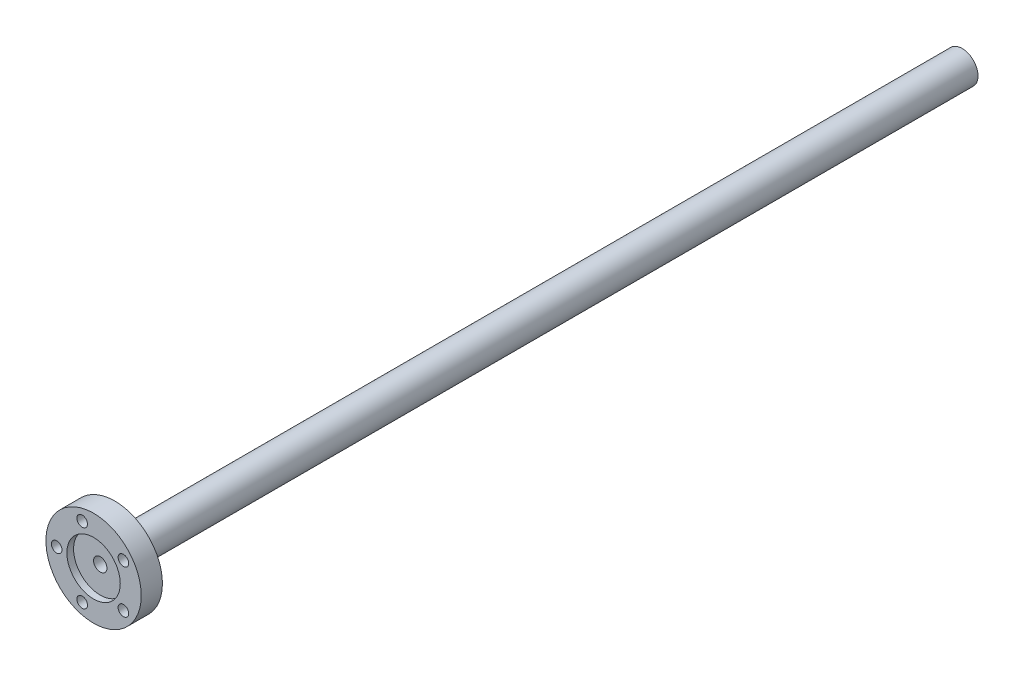
ISO-10303-21;
HEADER;
FILE_DESCRIPTION(('STEP AP214'),'2;1');
FILE_NAME('part.step','',(''),(''),'','','');
FILE_SCHEMA(('AUTOMOTIVE_DESIGN { 1 0 10303 214 1 1 1 1 }'));
ENDSEC;
DATA;
#1=APPLICATION_CONTEXT('core data for automotive mechanical design processes');
#2=APPLICATION_PROTOCOL_DEFINITION('international standard','automotive_design',2000,#1);
#3=PRODUCT_CONTEXT('',#1,'mechanical');
#4=PRODUCT('Part','Part','',(#3));
#5=PRODUCT_RELATED_PRODUCT_CATEGORY('part','',(#4));
#6=PRODUCT_DEFINITION_FORMATION('','',#4);
#7=PRODUCT_DEFINITION_CONTEXT('part definition',#1,'design');
#8=PRODUCT_DEFINITION('design','',#6,#7);
#9=PRODUCT_DEFINITION_SHAPE('','',#8);
#10=(LENGTH_UNIT() NAMED_UNIT(*) SI_UNIT(.MILLI.,.METRE.));
#11=(NAMED_UNIT(*) PLANE_ANGLE_UNIT() SI_UNIT($,.RADIAN.));
#12=(NAMED_UNIT(*) SI_UNIT($,.STERADIAN.) SOLID_ANGLE_UNIT());
#13=UNCERTAINTY_MEASURE_WITH_UNIT(LENGTH_MEASURE(1.E-05),#10,'distance_accuracy_value','');
#14=(GEOMETRIC_REPRESENTATION_CONTEXT(3) GLOBAL_UNCERTAINTY_ASSIGNED_CONTEXT((#13)) GLOBAL_UNIT_ASSIGNED_CONTEXT((#10,
#11,#12)) REPRESENTATION_CONTEXT('',''));
#15=CARTESIAN_POINT('',(0.,0.,0.));
#16=DIRECTION('',(0.,0.,1.));
#17=DIRECTION('',(1.,0.,0.));
#18=AXIS2_PLACEMENT_3D('',#15,#16,#17);
#19=CARTESIAN_POINT('',(14.2875,0.,-6.35));
#20=DIRECTION('',(0.,0.,-1.));
#21=DIRECTION('',(-1.,0.,0.));
#22=AXIS2_PLACEMENT_3D('',#19,#20,#21);
#23=PLANE('',#22);
#24=CARTESIAN_POINT('',(0.,0.,-6.35));
#25=DIRECTION('',(0.,0.,-1.));
#26=DIRECTION('',(-1.,0.,0.));
#27=AXIS2_PLACEMENT_3D('',#24,#25,#26);
#28=CIRCLE('',#27,5.5499);
#29=CARTESIAN_POINT('',(-5.5499,0.,-6.35));
#30=VERTEX_POINT('',#29);
#31=EDGE_CURVE('E11',#30,#30,#28,.F.);
#32=ORIENTED_EDGE('',*,*,#31,.T.);
#33=EDGE_LOOP('',(#32));
#34=FACE_BOUND('',#33,.T.);
#35=CARTESIAN_POINT('',(-3.41772795778692,10.5186850702244,-6.35));
#36=DIRECTION('',(0.,0.,-1.));
#37=DIRECTION('',(-1.,0.,0.));
#38=AXIS2_PLACEMENT_3D('',#35,#36,#37);
#39=CIRCLE('',#38,1.0922);
#40=CARTESIAN_POINT('',(-4.50992795778692,10.5186850702244,-6.35));
#41=VERTEX_POINT('',#40);
#42=EDGE_CURVE('E131',#41,#41,#39,.T.);
#43=ORIENTED_EDGE('',*,*,#42,.F.);
#44=EDGE_LOOP('',(#43));
#45=FACE_BOUND('',#44,.T.);
#46=CARTESIAN_POINT('',(8.94772795778692,6.50090489035475,-6.35));
#47=DIRECTION('',(0.,0.,-1.));
#48=DIRECTION('',(-1.,0.,0.));
#49=AXIS2_PLACEMENT_3D('',#46,#47,#48);
#50=CIRCLE('',#49,1.0922);
#51=CARTESIAN_POINT('',(7.85552795778692,6.50090489035475,-6.35));
#52=VERTEX_POINT('',#51);
#53=EDGE_CURVE('E126',#52,#52,#50,.T.);
#54=ORIENTED_EDGE('',*,*,#53,.F.);
#55=EDGE_LOOP('',(#54));
#56=FACE_BOUND('',#55,.T.);
#57=CARTESIAN_POINT('',(8.94772795778692,-6.50090489035475,-6.35));
#58=DIRECTION('',(0.,0.,-1.));
#59=DIRECTION('',(-1.,0.,0.));
#60=AXIS2_PLACEMENT_3D('',#57,#58,#59);
#61=CIRCLE('',#60,1.0922);
#62=CARTESIAN_POINT('',(7.85552795778692,-6.50090489035475,-6.35));
#63=VERTEX_POINT('',#62);
#64=EDGE_CURVE('E121',#63,#63,#61,.T.);
#65=ORIENTED_EDGE('',*,*,#64,.F.);
#66=EDGE_LOOP('',(#65));
#67=FACE_BOUND('',#66,.T.);
#68=CARTESIAN_POINT('',(-3.41772795778692,-10.5186850702244,-6.35));
#69=DIRECTION('',(0.,0.,-1.));
#70=DIRECTION('',(-1.,0.,0.));
#71=AXIS2_PLACEMENT_3D('',#68,#69,#70);
#72=CIRCLE('',#71,1.0922);
#73=CARTESIAN_POINT('',(-4.50992795778692,-10.5186850702244,-6.35));
#74=VERTEX_POINT('',#73);
#75=EDGE_CURVE('E116',#74,#74,#72,.T.);
#76=ORIENTED_EDGE('',*,*,#75,.F.);
#77=EDGE_LOOP('',(#76));
#78=FACE_BOUND('',#77,.T.);
#79=CARTESIAN_POINT('',(-11.06,0.,-6.34999999999999));
#80=DIRECTION('',(0.,0.,-1.));
#81=DIRECTION('',(-1.,0.,0.));
#82=AXIS2_PLACEMENT_3D('',#79,#80,#81);
#83=CIRCLE('',#82,1.5367);
#84=CARTESIAN_POINT('',(-12.5967,0.,-6.34999999999999));
#85=VERTEX_POINT('',#84);
#86=EDGE_CURVE('E302',#85,#85,#83,.T.);
#87=ORIENTED_EDGE('',*,*,#86,.F.);
#88=EDGE_LOOP('',(#87));
#89=FACE_BOUND('',#88,.T.);
#90=CARTESIAN_POINT('',(0.,0.,-6.35));
#91=DIRECTION('',(0.,0.,1.));
#92=DIRECTION('',(1.,0.,0.));
#93=AXIS2_PLACEMENT_3D('',#90,#91,#92);
#94=CIRCLE('',#93,14.2875);
#95=CARTESIAN_POINT('',(14.2875,0.,-6.35));
#96=VERTEX_POINT('',#95);
#97=EDGE_CURVE('E113',#96,#96,#94,.T.);
#98=ORIENTED_EDGE('',*,*,#97,.F.);
#99=EDGE_LOOP('',(#98));
#100=FACE_BOUND('',#99,.T.);
#101=ADVANCED_FACE('F31',(#34,#45,#56,#67,#78,#89,#100),#23,.T.);
#102=CARTESIAN_POINT('',(0.,0.,-6.35));
#103=DIRECTION('',(0.,0.,1.));
#104=DIRECTION('',(1.,0.,0.));
#105=AXIS2_PLACEMENT_3D('',#102,#103,#104);
#106=CYLINDRICAL_SURFACE('',#105,14.2875);
#107=ORIENTED_EDGE('',*,*,#97,.T.);
#108=EDGE_LOOP('',(#107));
#109=FACE_BOUND('',#108,.T.);
#110=CARTESIAN_POINT('',(0.,0.,0.));
#111=DIRECTION('',(0.,0.,1.));
#112=DIRECTION('',(1.,0.,0.));
#113=AXIS2_PLACEMENT_3D('',#110,#111,#112);
#114=CIRCLE('',#113,14.2875);
#115=CARTESIAN_POINT('',(14.2875,0.,0.));
#116=VERTEX_POINT('',#115);
#117=EDGE_CURVE('E110',#116,#116,#114,.T.);
#118=ORIENTED_EDGE('',*,*,#117,.F.);
#119=EDGE_LOOP('',(#118));
#120=FACE_BOUND('',#119,.T.);
#121=ADVANCED_FACE('F152',(#109,#120),#106,.T.);
#122=CARTESIAN_POINT('',(0.,0.,0.));
#123=DIRECTION('',(0.,0.,1.));
#124=DIRECTION('',(1.,0.,0.));
#125=AXIS2_PLACEMENT_3D('',#122,#123,#124);
#126=PLANE('',#125);
#127=CARTESIAN_POINT('',(0.,0.,0.));
#128=DIRECTION('',(0.,0.,1.));
#129=DIRECTION('',(1.,0.,0.));
#130=AXIS2_PLACEMENT_3D('',#127,#128,#129);
#131=CIRCLE('',#130,8.00000000000001);
#132=CARTESIAN_POINT('',(8.00000000000001,0.,0.));
#133=VERTEX_POINT('',#132);
#134=EDGE_CURVE('E259',#133,#133,#131,.T.);
#135=ORIENTED_EDGE('',*,*,#134,.F.);
#136=EDGE_LOOP('',(#135));
#137=FACE_BOUND('',#136,.T.);
#138=CARTESIAN_POINT('',(-3.41772795778692,10.5186850702244,0.));
#139=DIRECTION('',(0.,0.,1.));
#140=DIRECTION('',(1.,0.,0.));
#141=AXIS2_PLACEMENT_3D('',#138,#139,#140);
#142=CIRCLE('',#141,1.58750000000001);
#143=CARTESIAN_POINT('',(-1.83022795778691,10.5186850702244,0.));
#144=VERTEX_POINT('',#143);
#145=EDGE_CURVE('E268',#144,#144,#142,.T.);
#146=ORIENTED_EDGE('',*,*,#145,.F.);
#147=EDGE_LOOP('',(#146));
#148=FACE_BOUND('',#147,.T.);
#149=CARTESIAN_POINT('',(8.94772795778692,6.50090489035475,0.));
#150=DIRECTION('',(0.,0.,1.));
#151=DIRECTION('',(1.,0.,0.));
#152=AXIS2_PLACEMENT_3D('',#149,#150,#151);
#153=CIRCLE('',#152,1.58750000000001);
#154=CARTESIAN_POINT('',(10.5352279577869,6.50090489035475,0.));
#155=VERTEX_POINT('',#154);
#156=EDGE_CURVE('E133',#155,#155,#153,.T.);
#157=ORIENTED_EDGE('',*,*,#156,.F.);
#158=EDGE_LOOP('',(#157));
#159=FACE_BOUND('',#158,.T.);
#160=CARTESIAN_POINT('',(8.94772795778692,-6.50090489035475,0.));
#161=DIRECTION('',(0.,0.,1.));
#162=DIRECTION('',(1.,0.,0.));
#163=AXIS2_PLACEMENT_3D('',#160,#161,#162);
#164=CIRCLE('',#163,1.58750000000001);
#165=CARTESIAN_POINT('',(10.5352279577869,-6.50090489035475,0.));
#166=VERTEX_POINT('',#165);
#167=EDGE_CURVE('E129',#166,#166,#164,.T.);
#168=ORIENTED_EDGE('',*,*,#167,.F.);
#169=EDGE_LOOP('',(#168));
#170=FACE_BOUND('',#169,.T.);
#171=CARTESIAN_POINT('',(-3.41772795778692,-10.5186850702244,0.));
#172=DIRECTION('',(0.,0.,1.));
#173=DIRECTION('',(1.,0.,0.));
#174=AXIS2_PLACEMENT_3D('',#171,#172,#173);
#175=CIRCLE('',#174,1.58750000000001);
#176=CARTESIAN_POINT('',(-1.83022795778691,-10.5186850702244,0.));
#177=VERTEX_POINT('',#176);
#178=EDGE_CURVE('E124',#177,#177,#175,.T.);
#179=ORIENTED_EDGE('',*,*,#178,.F.);
#180=EDGE_LOOP('',(#179));
#181=FACE_BOUND('',#180,.T.);
#182=CARTESIAN_POINT('',(-11.06,0.,0.));
#183=DIRECTION('',(0.,0.,-1.));
#184=DIRECTION('',(-1.,0.,0.));
#185=AXIS2_PLACEMENT_3D('',#182,#183,#184);
#186=CIRCLE('',#185,1.5875);
#187=CARTESIAN_POINT('',(-12.6475,0.,0.));
#188=VERTEX_POINT('',#187);
#189=EDGE_CURVE('E101',#188,#188,#186,.T.);
#190=ORIENTED_EDGE('',*,*,#189,.T.);
#191=EDGE_LOOP('',(#190));
#192=FACE_BOUND('',#191,.T.);
#193=ORIENTED_EDGE('',*,*,#117,.T.);
#194=EDGE_LOOP('',(#193));
#195=FACE_BOUND('',#194,.T.);
#196=ADVANCED_FACE('F158',(#137,#148,#159,#170,#181,#192,#195),#126,.T.);
#197=CARTESIAN_POINT('',(0.,0.,-260.35));
#198=DIRECTION('',(0.,0.,1.));
#199=DIRECTION('',(1.,0.,0.));
#200=AXIS2_PLACEMENT_3D('',#197,#198,#199);
#201=CYLINDRICAL_SURFACE('',#200,4.7625);
#202=CARTESIAN_POINT('',(0.,0.,-7.13740000000002));
#203=DIRECTION('',(0.,0.,-1.));
#204=DIRECTION('',(-1.,0.,0.));
#205=AXIS2_PLACEMENT_3D('',#202,#203,#204);
#206=CIRCLE('',#205,4.7625);
#207=CARTESIAN_POINT('',(-4.7625,0.,-7.13740000000002));
#208=VERTEX_POINT('',#207);
#209=EDGE_CURVE('E39',#208,#208,#206,.T.);
#210=ORIENTED_EDGE('',*,*,#209,.T.);
#211=EDGE_LOOP('',(#210));
#212=FACE_BOUND('',#211,.T.);
#213=CARTESIAN_POINT('',(0.,0.,-228.346));
#214=DIRECTION('',(0.,0.,-1.));
#215=DIRECTION('',(-1.,0.,0.));
#216=AXIS2_PLACEMENT_3D('',#213,#214,#215);
#217=CIRCLE('',#216,4.7625);
#218=CARTESIAN_POINT('',(0.999999999999997,-4.65632969730452,-228.346));
#219=VERTEX_POINT('',#218);
#220=CARTESIAN_POINT('',(-0.99999999999999,-4.65632969730452,-228.346));
#221=VERTEX_POINT('',#220);
#222=EDGE_CURVE('E93',#219,#221,#217,.T.);
#223=ORIENTED_EDGE('',*,*,#222,.F.);
#224=DIRECTION('',(0.,0.,-1.));
#225=VECTOR('',#224,1.);
#226=CARTESIAN_POINT('',(0.999999999999997,-4.65632969730452,-228.346));
#227=LINE('',#226,#225);
#228=CARTESIAN_POINT('',(0.999999999999997,-4.65632969730452,-260.35));
#229=VERTEX_POINT('',#228);
#230=EDGE_CURVE('E55',#219,#229,#227,.T.);
#231=ORIENTED_EDGE('',*,*,#230,.T.);
#232=CARTESIAN_POINT('',(0.,0.,-260.35));
#233=DIRECTION('',(0.,0.,-1.));
#234=DIRECTION('',(-1.,0.,0.));
#235=AXIS2_PLACEMENT_3D('',#232,#233,#234);
#236=CIRCLE('',#235,4.7625);
#237=CARTESIAN_POINT('',(-0.99999999999999,-4.65632969730452,-260.35));
#238=VERTEX_POINT('',#237);
#239=EDGE_CURVE('E105',#238,#229,#236,.T.);
#240=ORIENTED_EDGE('',*,*,#239,.F.);
#241=DIRECTION('',(0.,0.,-1.));
#242=VECTOR('',#241,1.);
#243=CARTESIAN_POINT('',(-0.99999999999999,-4.65632969730452,-228.346));
#244=LINE('',#243,#242);
#245=EDGE_CURVE('E46',#221,#238,#244,.T.);
#246=ORIENTED_EDGE('',*,*,#245,.F.);
#247=EDGE_LOOP('',(#223,#231,#240,#246));
#248=FACE_BOUND('',#247,.T.);
#249=ADVANCED_FACE('F138',(#212,#248),#201,.T.);
#250=CARTESIAN_POINT('',(0.,0.,-260.35));
#251=DIRECTION('',(0.,0.,-1.));
#252=DIRECTION('',(-1.,0.,0.));
#253=AXIS2_PLACEMENT_3D('',#250,#251,#252);
#254=PLANE('',#253);
#255=DIRECTION('',(0.,-1.,0.));
#256=VECTOR('',#255,1.);
#257=CARTESIAN_POINT('',(0.999999999999997,-3.7833463510971,-260.35));
#258=LINE('',#257,#256);
#259=CARTESIAN_POINT('',(0.999999999999997,-3.7833463510971,-260.35));
#260=VERTEX_POINT('',#259);
#261=EDGE_CURVE('E70',#260,#229,#258,.T.);
#262=ORIENTED_EDGE('',*,*,#261,.F.);
#263=DIRECTION('',(1.,0.,0.));
#264=VECTOR('',#263,1.);
#265=CARTESIAN_POINT('',(-0.99999999999999,-3.7833463510971,-260.35));
#266=LINE('',#265,#264);
#267=CARTESIAN_POINT('',(-0.99999999999999,-3.7833463510971,-260.35));
#268=VERTEX_POINT('',#267);
#269=EDGE_CURVE('E100',#268,#260,#266,.T.);
#270=ORIENTED_EDGE('',*,*,#269,.F.);
#271=DIRECTION('',(0.,1.,0.));
#272=VECTOR('',#271,1.);
#273=CARTESIAN_POINT('',(-0.99999999999999,-4.65632969730452,-260.35));
#274=LINE('',#273,#272);
#275=EDGE_CURVE('E79',#238,#268,#274,.T.);
#276=ORIENTED_EDGE('',*,*,#275,.F.);
#277=ORIENTED_EDGE('',*,*,#239,.T.);
#278=EDGE_LOOP('',(#262,#270,#276,#277));
#279=FACE_BOUND('',#278,.T.);
#280=ADVANCED_FACE('F167',(#279),#254,.T.);
#281=CARTESIAN_POINT('',(0.999999999999997,-3.7833463510971,-228.346));
#282=DIRECTION('',(1.,0.,0.));
#283=DIRECTION('',(0.,1.,0.));
#284=AXIS2_PLACEMENT_3D('',#281,#282,#283);
#285=PLANE('',#284);
#286=ORIENTED_EDGE('',*,*,#261,.T.);
#287=ORIENTED_EDGE('',*,*,#230,.F.);
#288=DIRECTION('',(0.,-1.,0.));
#289=VECTOR('',#288,1.);
#290=CARTESIAN_POINT('',(0.999999999999997,-3.7833463510971,-228.346));
#291=LINE('',#290,#289);
#292=CARTESIAN_POINT('',(0.999999999999997,-3.7833463510971,-228.346));
#293=VERTEX_POINT('',#292);
#294=EDGE_CURVE('E89',#293,#219,#291,.T.);
#295=ORIENTED_EDGE('',*,*,#294,.F.);
#296=DIRECTION('',(0.,0.,-1.));
#297=VECTOR('',#296,1.);
#298=CARTESIAN_POINT('',(0.999999999999997,-3.7833463510971,-228.346));
#299=LINE('',#298,#297);
#300=EDGE_CURVE('E83',#293,#260,#299,.T.);
#301=ORIENTED_EDGE('',*,*,#300,.T.);
#302=EDGE_LOOP('',(#286,#287,#295,#301));
#303=FACE_BOUND('',#302,.T.);
#304=ADVANCED_FACE('F170',(#303),#285,.F.);
#305=CARTESIAN_POINT('',(-0.99999999999999,-3.7833463510971,-228.346));
#306=DIRECTION('',(0.,1.,0.));
#307=DIRECTION('',(-1.,0.,0.));
#308=AXIS2_PLACEMENT_3D('',#305,#306,#307);
#309=PLANE('',#308);
#310=ORIENTED_EDGE('',*,*,#269,.T.);
#311=ORIENTED_EDGE('',*,*,#300,.F.);
#312=DIRECTION('',(1.,0.,0.));
#313=VECTOR('',#312,1.);
#314=CARTESIAN_POINT('',(-0.99999999999999,-3.7833463510971,-228.346));
#315=LINE('',#314,#313);
#316=CARTESIAN_POINT('',(-0.99999999999999,-3.7833463510971,-228.346));
#317=VERTEX_POINT('',#316);
#318=EDGE_CURVE('E86',#317,#293,#315,.T.);
#319=ORIENTED_EDGE('',*,*,#318,.F.);
#320=DIRECTION('',(0.,0.,-1.));
#321=VECTOR('',#320,1.);
#322=CARTESIAN_POINT('',(-0.99999999999999,-3.7833463510971,-228.346));
#323=LINE('',#322,#321);
#324=EDGE_CURVE('E76',#317,#268,#323,.T.);
#325=ORIENTED_EDGE('',*,*,#324,.T.);
#326=EDGE_LOOP('',(#310,#311,#319,#325));
#327=FACE_BOUND('',#326,.T.);
#328=ADVANCED_FACE('F87',(#327),#309,.F.);
#329=CARTESIAN_POINT('',(-0.99999999999999,-4.65632969730452,-228.346));
#330=DIRECTION('',(-1.,0.,0.));
#331=DIRECTION('',(0.,0.,1.));
#332=AXIS2_PLACEMENT_3D('',#329,#330,#331);
#333=PLANE('',#332);
#334=ORIENTED_EDGE('',*,*,#275,.T.);
#335=ORIENTED_EDGE('',*,*,#324,.F.);
#336=DIRECTION('',(0.,1.,0.));
#337=VECTOR('',#336,1.);
#338=CARTESIAN_POINT('',(-0.99999999999999,-4.65632969730452,-228.346));
#339=LINE('',#338,#337);
#340=EDGE_CURVE('E74',#221,#317,#339,.T.);
#341=ORIENTED_EDGE('',*,*,#340,.F.);
#342=ORIENTED_EDGE('',*,*,#245,.T.);
#343=EDGE_LOOP('',(#334,#335,#341,#342));
#344=FACE_BOUND('',#343,.T.);
#345=ADVANCED_FACE('F78',(#344),#333,.F.);
#346=CARTESIAN_POINT('',(0.,0.,-228.346));
#347=DIRECTION('',(0.,0.,-1.));
#348=DIRECTION('',(-1.,0.,0.));
#349=AXIS2_PLACEMENT_3D('',#346,#347,#348);
#350=PLANE('',#349);
#351=ORIENTED_EDGE('',*,*,#222,.T.);
#352=ORIENTED_EDGE('',*,*,#340,.T.);
#353=ORIENTED_EDGE('',*,*,#318,.T.);
#354=ORIENTED_EDGE('',*,*,#294,.T.);
#355=EDGE_LOOP('',(#351,#352,#353,#354));
#356=FACE_BOUND('',#355,.T.);
#357=ADVANCED_FACE('F91',(#356),#350,.T.);
#358=CARTESIAN_POINT('',(-11.06,0.,0.));
#359=DIRECTION('',(0.,0.,-1.));
#360=DIRECTION('',(-1.,0.,0.));
#361=AXIS2_PLACEMENT_3D('',#358,#359,#360);
#362=CYLINDRICAL_SURFACE('',#361,1.5875);
#363=ORIENTED_EDGE('',*,*,#189,.F.);
#364=EDGE_LOOP('',(#363));
#365=FACE_BOUND('',#364,.T.);
#366=CARTESIAN_POINT('',(-11.06,0.,-4.7625));
#367=DIRECTION('',(0.,0.,-1.));
#368=DIRECTION('',(-1.,0.,0.));
#369=AXIS2_PLACEMENT_3D('',#366,#367,#368);
#370=CIRCLE('',#369,1.5875);
#371=CARTESIAN_POINT('',(-12.6475,0.,-4.7625));
#372=VERTEX_POINT('',#371);
#373=EDGE_CURVE('E119',#372,#372,#370,.T.);
#374=ORIENTED_EDGE('',*,*,#373,.T.);
#375=EDGE_LOOP('',(#374));
#376=FACE_BOUND('',#375,.T.);
#377=ADVANCED_FACE('F180',(#365,#376),#362,.F.);
#378=CARTESIAN_POINT('',(-11.06,0.,0.));
#379=DIRECTION('',(0.,0.,-1.));
#380=DIRECTION('',(-1.,0.,0.));
#381=AXIS2_PLACEMENT_3D('',#378,#379,#380);
#382=CYLINDRICAL_SURFACE('',#381,1.5367);
#383=CARTESIAN_POINT('',(-11.06,0.,-4.7625));
#384=DIRECTION('',(0.,0.,-1.));
#385=DIRECTION('',(-1.,0.,0.));
#386=AXIS2_PLACEMENT_3D('',#383,#384,#385);
#387=CIRCLE('',#386,1.5367);
#388=CARTESIAN_POINT('',(-12.5967,0.,-4.7625));
#389=VERTEX_POINT('',#388);
#390=EDGE_CURVE('E299',#389,#389,#387,.T.);
#391=ORIENTED_EDGE('',*,*,#390,.F.);
#392=EDGE_LOOP('',(#391));
#393=FACE_BOUND('',#392,.T.);
#394=ORIENTED_EDGE('',*,*,#86,.T.);
#395=EDGE_LOOP('',(#394));
#396=FACE_BOUND('',#395,.T.);
#397=ADVANCED_FACE('F183',(#393,#396),#382,.F.);
#398=CARTESIAN_POINT('',(-9.5233,0.,-4.7625));
#399=DIRECTION('',(0.,0.,-1.));
#400=DIRECTION('',(-1.,0.,0.));
#401=AXIS2_PLACEMENT_3D('',#398,#399,#400);
#402=PLANE('',#401);
#403=ORIENTED_EDGE('',*,*,#373,.F.);
#404=EDGE_LOOP('',(#403));
#405=FACE_BOUND('',#404,.T.);
#406=ORIENTED_EDGE('',*,*,#390,.T.);
#407=EDGE_LOOP('',(#406));
#408=FACE_BOUND('',#407,.T.);
#409=ADVANCED_FACE('F187',(#405,#408),#402,.F.);
#410=CARTESIAN_POINT('',(-3.41772795778692,-10.5186850702244,0.));
#411=DIRECTION('',(0.,0.,1.));
#412=DIRECTION('',(1.,0.,0.));
#413=AXIS2_PLACEMENT_3D('',#410,#411,#412);
#414=CYLINDRICAL_SURFACE('',#413,1.0922);
#415=ORIENTED_EDGE('',*,*,#75,.T.);
#416=EDGE_LOOP('',(#415));
#417=FACE_BOUND('',#416,.T.);
#418=CARTESIAN_POINT('',(-3.41772795778692,-10.5186850702244,-4.7625));
#419=DIRECTION('',(0.,0.,1.));
#420=DIRECTION('',(1.,0.,0.));
#421=AXIS2_PLACEMENT_3D('',#418,#419,#420);
#422=CIRCLE('',#421,1.09220000000001);
#423=CARTESIAN_POINT('',(-2.32552795778691,-10.5186850702244,-4.7625));
#424=VERTEX_POINT('',#423);
#425=EDGE_CURVE('E120',#424,#424,#422,.T.);
#426=ORIENTED_EDGE('',*,*,#425,.T.);
#427=EDGE_LOOP('',(#426));
#428=FACE_BOUND('',#427,.T.);
#429=ADVANCED_FACE('F191',(#417,#428),#414,.F.);
#430=CARTESIAN_POINT('',(-2.32552795778691,-10.5186850702244,-4.7625));
#431=DIRECTION('',(0.,0.,-1.));
#432=DIRECTION('',(-1.,0.,0.));
#433=AXIS2_PLACEMENT_3D('',#430,#431,#432);
#434=PLANE('',#433);
#435=ORIENTED_EDGE('',*,*,#425,.F.);
#436=EDGE_LOOP('',(#435));
#437=FACE_BOUND('',#436,.T.);
#438=CARTESIAN_POINT('',(-3.41772795778692,-10.5186850702244,-4.7625));
#439=DIRECTION('',(0.,0.,1.));
#440=DIRECTION('',(1.,0.,0.));
#441=AXIS2_PLACEMENT_3D('',#438,#439,#440);
#442=CIRCLE('',#441,1.58750000000001);
#443=CARTESIAN_POINT('',(-1.83022795778691,-10.5186850702244,-4.7625));
#444=VERTEX_POINT('',#443);
#445=EDGE_CURVE('E292',#444,#444,#442,.T.);
#446=ORIENTED_EDGE('',*,*,#445,.T.);
#447=EDGE_LOOP('',(#446));
#448=FACE_BOUND('',#447,.T.);
#449=ADVANCED_FACE('F195',(#437,#448),#434,.F.);
#450=CARTESIAN_POINT('',(-3.41772795778692,-10.5186850702244,0.));
#451=DIRECTION('',(0.,0.,1.));
#452=DIRECTION('',(1.,0.,0.));
#453=AXIS2_PLACEMENT_3D('',#450,#451,#452);
#454=CYLINDRICAL_SURFACE('',#453,1.58750000000001);
#455=ORIENTED_EDGE('',*,*,#445,.F.);
#456=EDGE_LOOP('',(#455));
#457=FACE_BOUND('',#456,.T.);
#458=ORIENTED_EDGE('',*,*,#178,.T.);
#459=EDGE_LOOP('',(#458));
#460=FACE_BOUND('',#459,.T.);
#461=ADVANCED_FACE('F199',(#457,#460),#454,.F.);
#462=CARTESIAN_POINT('',(8.94772795778692,-6.50090489035475,0.));
#463=DIRECTION('',(0.,0.,1.));
#464=DIRECTION('',(1.,0.,0.));
#465=AXIS2_PLACEMENT_3D('',#462,#463,#464);
#466=CYLINDRICAL_SURFACE('',#465,1.0922);
#467=ORIENTED_EDGE('',*,*,#64,.T.);
#468=EDGE_LOOP('',(#467));
#469=FACE_BOUND('',#468,.T.);
#470=CARTESIAN_POINT('',(8.94772795778692,-6.50090489035475,-4.7625));
#471=DIRECTION('',(0.,0.,1.));
#472=DIRECTION('',(1.,0.,0.));
#473=AXIS2_PLACEMENT_3D('',#470,#471,#472);
#474=CIRCLE('',#473,1.09220000000001);
#475=CARTESIAN_POINT('',(10.0399279577869,-6.50090489035475,-4.7625));
#476=VERTEX_POINT('',#475);
#477=EDGE_CURVE('E125',#476,#476,#474,.T.);
#478=ORIENTED_EDGE('',*,*,#477,.T.);
#479=EDGE_LOOP('',(#478));
#480=FACE_BOUND('',#479,.T.);
#481=ADVANCED_FACE('F203',(#469,#480),#466,.F.);
#482=CARTESIAN_POINT('',(10.0399279577869,-6.50090489035475,-4.7625));
#483=DIRECTION('',(0.,0.,-1.));
#484=DIRECTION('',(-1.,0.,0.));
#485=AXIS2_PLACEMENT_3D('',#482,#483,#484);
#486=PLANE('',#485);
#487=ORIENTED_EDGE('',*,*,#477,.F.);
#488=EDGE_LOOP('',(#487));
#489=FACE_BOUND('',#488,.T.);
#490=CARTESIAN_POINT('',(8.94772795778692,-6.50090489035475,-4.7625));
#491=DIRECTION('',(0.,0.,1.));
#492=DIRECTION('',(1.,0.,0.));
#493=AXIS2_PLACEMENT_3D('',#490,#491,#492);
#494=CIRCLE('',#493,1.58750000000001);
#495=CARTESIAN_POINT('',(10.5352279577869,-6.50090489035475,-4.7625));
#496=VERTEX_POINT('',#495);
#497=EDGE_CURVE('E285',#496,#496,#494,.T.);
#498=ORIENTED_EDGE('',*,*,#497,.T.);
#499=EDGE_LOOP('',(#498));
#500=FACE_BOUND('',#499,.T.);
#501=ADVANCED_FACE('F207',(#489,#500),#486,.F.);
#502=CARTESIAN_POINT('',(8.94772795778692,-6.50090489035475,0.));
#503=DIRECTION('',(0.,0.,1.));
#504=DIRECTION('',(1.,0.,0.));
#505=AXIS2_PLACEMENT_3D('',#502,#503,#504);
#506=CYLINDRICAL_SURFACE('',#505,1.58750000000001);
#507=ORIENTED_EDGE('',*,*,#497,.F.);
#508=EDGE_LOOP('',(#507));
#509=FACE_BOUND('',#508,.T.);
#510=ORIENTED_EDGE('',*,*,#167,.T.);
#511=EDGE_LOOP('',(#510));
#512=FACE_BOUND('',#511,.T.);
#513=ADVANCED_FACE('F211',(#509,#512),#506,.F.);
#514=CARTESIAN_POINT('',(8.94772795778692,6.50090489035475,0.));
#515=DIRECTION('',(0.,0.,1.));
#516=DIRECTION('',(1.,0.,0.));
#517=AXIS2_PLACEMENT_3D('',#514,#515,#516);
#518=CYLINDRICAL_SURFACE('',#517,1.0922);
#519=ORIENTED_EDGE('',*,*,#53,.T.);
#520=EDGE_LOOP('',(#519));
#521=FACE_BOUND('',#520,.T.);
#522=CARTESIAN_POINT('',(8.94772795778692,6.50090489035475,-4.7625));
#523=DIRECTION('',(0.,0.,1.));
#524=DIRECTION('',(1.,0.,0.));
#525=AXIS2_PLACEMENT_3D('',#522,#523,#524);
#526=CIRCLE('',#525,1.09220000000001);
#527=CARTESIAN_POINT('',(10.0399279577869,6.50090489035475,-4.7625));
#528=VERTEX_POINT('',#527);
#529=EDGE_CURVE('E130',#528,#528,#526,.T.);
#530=ORIENTED_EDGE('',*,*,#529,.T.);
#531=EDGE_LOOP('',(#530));
#532=FACE_BOUND('',#531,.T.);
#533=ADVANCED_FACE('F215',(#521,#532),#518,.F.);
#534=CARTESIAN_POINT('',(10.0399279577869,6.50090489035475,-4.7625));
#535=DIRECTION('',(0.,0.,-1.));
#536=DIRECTION('',(-1.,0.,0.));
#537=AXIS2_PLACEMENT_3D('',#534,#535,#536);
#538=PLANE('',#537);
#539=ORIENTED_EDGE('',*,*,#529,.F.);
#540=EDGE_LOOP('',(#539));
#541=FACE_BOUND('',#540,.T.);
#542=CARTESIAN_POINT('',(8.94772795778692,6.50090489035475,-4.7625));
#543=DIRECTION('',(0.,0.,1.));
#544=DIRECTION('',(1.,0.,0.));
#545=AXIS2_PLACEMENT_3D('',#542,#543,#544);
#546=CIRCLE('',#545,1.58750000000001);
#547=CARTESIAN_POINT('',(10.5352279577869,6.50090489035475,-4.7625));
#548=VERTEX_POINT('',#547);
#549=EDGE_CURVE('E278',#548,#548,#546,.T.);
#550=ORIENTED_EDGE('',*,*,#549,.T.);
#551=EDGE_LOOP('',(#550));
#552=FACE_BOUND('',#551,.T.);
#553=ADVANCED_FACE('F219',(#541,#552),#538,.F.);
#554=CARTESIAN_POINT('',(8.94772795778692,6.50090489035475,0.));
#555=DIRECTION('',(0.,0.,1.));
#556=DIRECTION('',(1.,0.,0.));
#557=AXIS2_PLACEMENT_3D('',#554,#555,#556);
#558=CYLINDRICAL_SURFACE('',#557,1.58750000000001);
#559=ORIENTED_EDGE('',*,*,#549,.F.);
#560=EDGE_LOOP('',(#559));
#561=FACE_BOUND('',#560,.T.);
#562=ORIENTED_EDGE('',*,*,#156,.T.);
#563=EDGE_LOOP('',(#562));
#564=FACE_BOUND('',#563,.T.);
#565=ADVANCED_FACE('F223',(#561,#564),#558,.F.);
#566=CARTESIAN_POINT('',(-3.41772795778692,10.5186850702244,0.));
#567=DIRECTION('',(0.,0.,1.));
#568=DIRECTION('',(1.,0.,0.));
#569=AXIS2_PLACEMENT_3D('',#566,#567,#568);
#570=CYLINDRICAL_SURFACE('',#569,1.0922);
#571=ORIENTED_EDGE('',*,*,#42,.T.);
#572=EDGE_LOOP('',(#571));
#573=FACE_BOUND('',#572,.T.);
#574=CARTESIAN_POINT('',(-3.41772795778692,10.5186850702244,-4.7625));
#575=DIRECTION('',(0.,0.,1.));
#576=DIRECTION('',(1.,0.,0.));
#577=AXIS2_PLACEMENT_3D('',#574,#575,#576);
#578=CIRCLE('',#577,1.09220000000001);
#579=CARTESIAN_POINT('',(-2.32552795778691,10.5186850702244,-4.7625));
#580=VERTEX_POINT('',#579);
#581=EDGE_CURVE('E134',#580,#580,#578,.T.);
#582=ORIENTED_EDGE('',*,*,#581,.T.);
#583=EDGE_LOOP('',(#582));
#584=FACE_BOUND('',#583,.T.);
#585=ADVANCED_FACE('F227',(#573,#584),#570,.F.);
#586=CARTESIAN_POINT('',(-2.32552795778691,10.5186850702244,-4.7625));
#587=DIRECTION('',(0.,0.,-1.));
#588=DIRECTION('',(-1.,0.,0.));
#589=AXIS2_PLACEMENT_3D('',#586,#587,#588);
#590=PLANE('',#589);
#591=ORIENTED_EDGE('',*,*,#581,.F.);
#592=EDGE_LOOP('',(#591));
#593=FACE_BOUND('',#592,.T.);
#594=CARTESIAN_POINT('',(-3.41772795778692,10.5186850702244,-4.7625));
#595=DIRECTION('',(0.,0.,1.));
#596=DIRECTION('',(1.,0.,0.));
#597=AXIS2_PLACEMENT_3D('',#594,#595,#596);
#598=CIRCLE('',#597,1.58750000000001);
#599=CARTESIAN_POINT('',(-1.83022795778691,10.5186850702244,-4.7625));
#600=VERTEX_POINT('',#599);
#601=EDGE_CURVE('E271',#600,#600,#598,.T.);
#602=ORIENTED_EDGE('',*,*,#601,.T.);
#603=EDGE_LOOP('',(#602));
#604=FACE_BOUND('',#603,.T.);
#605=ADVANCED_FACE('F231',(#593,#604),#590,.F.);
#606=CARTESIAN_POINT('',(-3.41772795778692,10.5186850702244,0.));
#607=DIRECTION('',(0.,0.,1.));
#608=DIRECTION('',(1.,0.,0.));
#609=AXIS2_PLACEMENT_3D('',#606,#607,#608);
#610=CYLINDRICAL_SURFACE('',#609,1.58750000000001);
#611=ORIENTED_EDGE('',*,*,#601,.F.);
#612=EDGE_LOOP('',(#611));
#613=FACE_BOUND('',#612,.T.);
#614=ORIENTED_EDGE('',*,*,#145,.T.);
#615=EDGE_LOOP('',(#614));
#616=FACE_BOUND('',#615,.T.);
#617=ADVANCED_FACE('F235',(#613,#616),#610,.F.);
#618=CARTESIAN_POINT('',(0.,0.,-5.));
#619=DIRECTION('',(0.,0.,-1.));
#620=DIRECTION('',(-1.,0.,0.));
#621=AXIS2_PLACEMENT_3D('',#618,#619,#620);
#622=PLANE('',#621);
#623=CARTESIAN_POINT('',(0.,0.,-5.));
#624=DIRECTION('',(0.,0.,1.));
#625=DIRECTION('',(1.,0.,0.));
#626=AXIS2_PLACEMENT_3D('',#623,#624,#625);
#627=CIRCLE('',#626,2.00000000000001);
#628=CARTESIAN_POINT('',(2.00000000000001,0.,-5.));
#629=VERTEX_POINT('',#628);
#630=EDGE_CURVE('E261',#629,#629,#627,.T.);
#631=ORIENTED_EDGE('',*,*,#630,.T.);
#632=EDGE_LOOP('',(#631));
#633=FACE_BOUND('',#632,.T.);
#634=ADVANCED_FACE('F239',(#633),#622,.F.);
#635=CARTESIAN_POINT('',(0.,0.,0.));
#636=DIRECTION('',(0.,0.,1.));
#637=DIRECTION('',(1.,0.,0.));
#638=AXIS2_PLACEMENT_3D('',#635,#636,#637);
#639=CYLINDRICAL_SURFACE('',#638,2.00000000000001);
#640=ORIENTED_EDGE('',*,*,#630,.F.);
#641=EDGE_LOOP('',(#640));
#642=FACE_BOUND('',#641,.T.);
#643=CARTESIAN_POINT('',(0.,0.,-2.));
#644=DIRECTION('',(0.,0.,1.));
#645=DIRECTION('',(1.,0.,0.));
#646=AXIS2_PLACEMENT_3D('',#643,#644,#645);
#647=CIRCLE('',#646,2.00000000000001);
#648=CARTESIAN_POINT('',(2.00000000000001,0.,-2.));
#649=VERTEX_POINT('',#648);
#650=EDGE_CURVE('E255',#649,#649,#647,.T.);
#651=ORIENTED_EDGE('',*,*,#650,.T.);
#652=EDGE_LOOP('',(#651));
#653=FACE_BOUND('',#652,.T.);
#654=ADVANCED_FACE('F243',(#642,#653),#639,.F.);
#655=CARTESIAN_POINT('',(2.00000000000001,0.,-2.));
#656=DIRECTION('',(0.,0.,-1.));
#657=DIRECTION('',(-1.,0.,0.));
#658=AXIS2_PLACEMENT_3D('',#655,#656,#657);
#659=PLANE('',#658);
#660=ORIENTED_EDGE('',*,*,#650,.F.);
#661=EDGE_LOOP('',(#660));
#662=FACE_BOUND('',#661,.T.);
#663=CARTESIAN_POINT('',(0.,0.,-2.));
#664=DIRECTION('',(0.,0.,1.));
#665=DIRECTION('',(1.,0.,0.));
#666=AXIS2_PLACEMENT_3D('',#663,#664,#665);
#667=CIRCLE('',#666,8.00000000000001);
#668=CARTESIAN_POINT('',(8.00000000000001,0.,-2.));
#669=VERTEX_POINT('',#668);
#670=EDGE_CURVE('E258',#669,#669,#667,.T.);
#671=ORIENTED_EDGE('',*,*,#670,.T.);
#672=EDGE_LOOP('',(#671));
#673=FACE_BOUND('',#672,.T.);
#674=ADVANCED_FACE('F147',(#662,#673),#659,.F.);
#675=CARTESIAN_POINT('',(0.,0.,0.));
#676=DIRECTION('',(0.,0.,1.));
#677=DIRECTION('',(1.,0.,0.));
#678=AXIS2_PLACEMENT_3D('',#675,#676,#677);
#679=CYLINDRICAL_SURFACE('',#678,8.00000000000001);
#680=ORIENTED_EDGE('',*,*,#670,.F.);
#681=EDGE_LOOP('',(#680));
#682=FACE_BOUND('',#681,.T.);
#683=ORIENTED_EDGE('',*,*,#134,.T.);
#684=EDGE_LOOP('',(#683));
#685=FACE_BOUND('',#684,.T.);
#686=ADVANCED_FACE('F142',(#682,#685),#679,.F.);
#687=CARTESIAN_POINT('',(0.,0.,-7.13740000000002));
#688=DIRECTION('',(0.,0.,-1.));
#689=DIRECTION('',(-1.,0.,0.));
#690=AXIS2_PLACEMENT_3D('',#687,#688,#689);
#691=TOROIDAL_SURFACE('',#690,5.5499,0.7874);
#692=ORIENTED_EDGE('',*,*,#31,.F.);
#693=EDGE_LOOP('',(#692));
#694=FACE_BOUND('',#693,.T.);
#695=ORIENTED_EDGE('',*,*,#209,.F.);
#696=EDGE_LOOP('',(#695));
#697=FACE_BOUND('',#696,.T.);
#698=ADVANCED_FACE('F33',(#694,#697),#691,.F.);
#699=CLOSED_SHELL('',(#101,#121,#196,#249,#280,#304,#328,#345,#357,#377,#397,#409,#429,#449,
#461,#481,#501,#513,#533,#553,#565,#585,#605,#617,#634,#654,#674,#686,#698));
#700=MANIFOLD_SOLID_BREP('B2',#699);
#701=ADVANCED_BREP_SHAPE_REPRESENTATION('',(#18,#700),#14);
#702=SHAPE_DEFINITION_REPRESENTATION(#9,#701);
ENDSEC;
END-ISO-10303-21;
